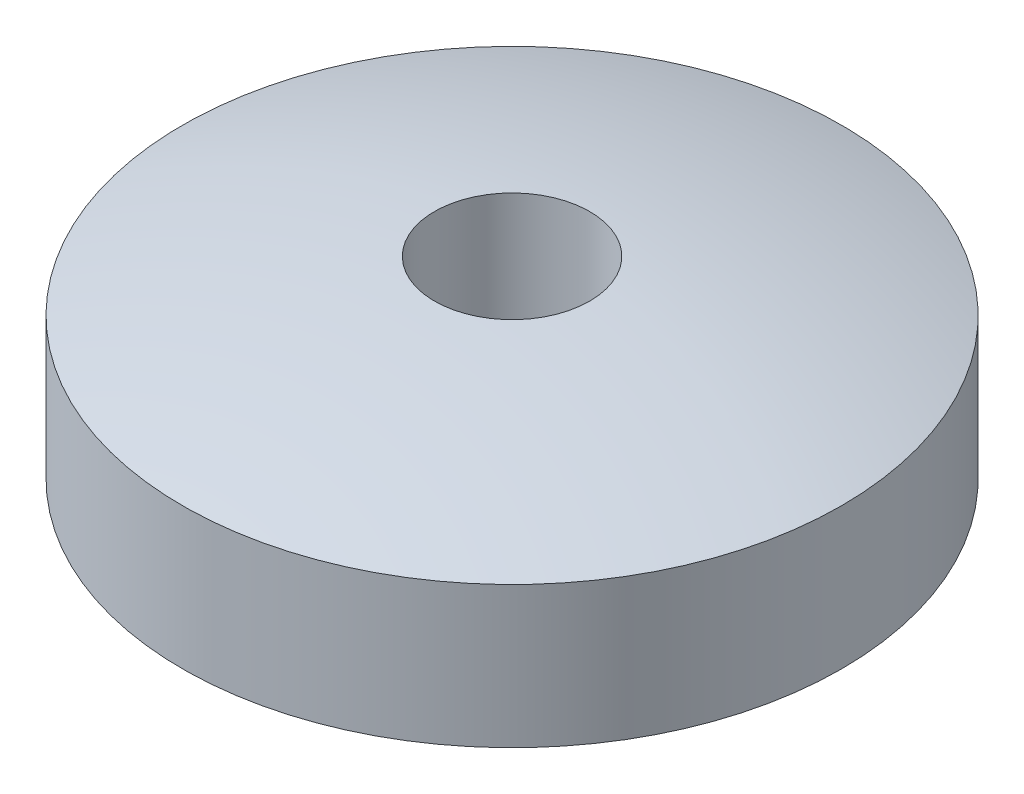
ISO-10303-21;
HEADER;
FILE_DESCRIPTION(('STEP AP214'),'2;1');
FILE_NAME('part.step','',(''),(''),'','','');
FILE_SCHEMA(('AUTOMOTIVE_DESIGN { 1 0 10303 214 1 1 1 1 }'));
ENDSEC;
DATA;
#1=APPLICATION_CONTEXT('core data for automotive mechanical design processes');
#2=APPLICATION_PROTOCOL_DEFINITION('international standard','automotive_design',2000,#1);
#3=PRODUCT_CONTEXT('',#1,'mechanical');
#4=PRODUCT('Part','Part','',(#3));
#5=PRODUCT_RELATED_PRODUCT_CATEGORY('part','',(#4));
#6=PRODUCT_DEFINITION_FORMATION('','',#4);
#7=PRODUCT_DEFINITION_CONTEXT('part definition',#1,'design');
#8=PRODUCT_DEFINITION('design','',#6,#7);
#9=PRODUCT_DEFINITION_SHAPE('','',#8);
#10=(LENGTH_UNIT() NAMED_UNIT(*) SI_UNIT(.MILLI.,.METRE.));
#11=(NAMED_UNIT(*) PLANE_ANGLE_UNIT() SI_UNIT($,.RADIAN.));
#12=(NAMED_UNIT(*) SI_UNIT($,.STERADIAN.) SOLID_ANGLE_UNIT());
#13=UNCERTAINTY_MEASURE_WITH_UNIT(LENGTH_MEASURE(1.E-05),#10,'distance_accuracy_value','');
#14=(GEOMETRIC_REPRESENTATION_CONTEXT(3) GLOBAL_UNCERTAINTY_ASSIGNED_CONTEXT((#13)) GLOBAL_UNIT_ASSIGNED_CONTEXT((#10,
#11,#12)) REPRESENTATION_CONTEXT('',''));
#15=CARTESIAN_POINT('',(0.,0.,0.));
#16=DIRECTION('',(0.,0.,1.));
#17=DIRECTION('',(1.,0.,0.));
#18=AXIS2_PLACEMENT_3D('',#15,#16,#17);
#19=CARTESIAN_POINT('',(0.,-1.14009752081384,0.));
#20=DIRECTION('',(0.,-1.,0.));
#21=DIRECTION('',(-1.,0.,0.));
#22=AXIS2_PLACEMENT_3D('',#19,#20,#21);
#23=SPHERICAL_SURFACE('',#22,1.40699999999863);
#24=CARTESIAN_POINT('',(0.,0.192999999997889,0.));
#25=DIRECTION('',(0.,-1.,0.));
#26=DIRECTION('',(1.,0.,0.));
#27=AXIS2_PLACEMENT_3D('',#24,#25,#26);
#28=CIRCLE('',#27,0.450000000000363);
#29=CARTESIAN_POINT('',(0.450000000000362,0.192999999997891,0.));
#30=VERTEX_POINT('',#29);
#31=EDGE_CURVE('E10',#30,#30,#28,.T.);
#32=ORIENTED_EDGE('',*,*,#31,.F.);
#33=EDGE_LOOP('',(#32));
#34=FACE_BOUND('',#33,.T.);
#35=CARTESIAN_POINT('',(0.,0.262903904701295,0.));
#36=DIRECTION('',(0.,-1.,0.));
#37=DIRECTION('',(1.,0.,0.));
#38=AXIS2_PLACEMENT_3D('',#35,#36,#37);
#39=CIRCLE('',#38,0.105999999999999);
#40=CARTESIAN_POINT('',(0.105999999999998,0.262903904701295,0.));
#41=VERTEX_POINT('',#40);
#42=EDGE_CURVE('E52',#41,#41,#39,.T.);
#43=ORIENTED_EDGE('',*,*,#42,.T.);
#44=EDGE_LOOP('',(#43));
#45=FACE_BOUND('',#44,.T.);
#46=ADVANCED_FACE('F33',(#34,#45),#23,.T.);
#47=CARTESIAN_POINT('',(3.49148133884313E-12,-1000.,0.));
#48=DIRECTION('',(0.,-1.,0.));
#49=DIRECTION('',(1.,0.,0.));
#50=AXIS2_PLACEMENT_3D('',#47,#48,#49);
#51=CYLINDRICAL_SURFACE('',#50,0.450000000000363);
#52=CARTESIAN_POINT('',(0.,0.,0.));
#53=DIRECTION('',(0.,-1.,0.));
#54=DIRECTION('',(1.,0.,0.));
#55=AXIS2_PLACEMENT_3D('',#52,#53,#54);
#56=CIRCLE('',#55,0.450000000000364);
#57=CARTESIAN_POINT('',(0.450000000000364,0.,0.));
#58=VERTEX_POINT('',#57);
#59=EDGE_CURVE('E39',#58,#58,#56,.T.);
#60=ORIENTED_EDGE('',*,*,#59,.F.);
#61=EDGE_LOOP('',(#60));
#62=FACE_BOUND('',#61,.T.);
#63=ORIENTED_EDGE('',*,*,#31,.T.);
#64=EDGE_LOOP('',(#63));
#65=FACE_BOUND('',#64,.T.);
#66=ADVANCED_FACE('F71',(#62,#65),#51,.T.);
#67=CARTESIAN_POINT('',(-0.450000000000364,0.,0.));
#68=DIRECTION('',(0.,1.,0.));
#69=DIRECTION('',(-1.,0.,0.));
#70=AXIS2_PLACEMENT_3D('',#67,#68,#69);
#71=PLANE('',#70);
#72=CARTESIAN_POINT('',(0.,0.,0.));
#73=DIRECTION('',(0.,-1.,0.));
#74=DIRECTION('',(1.,0.,0.));
#75=AXIS2_PLACEMENT_3D('',#72,#73,#74);
#76=CIRCLE('',#75,0.309);
#77=CARTESIAN_POINT('',(0.309,0.,0.));
#78=VERTEX_POINT('',#77);
#79=EDGE_CURVE('E43',#78,#78,#76,.T.);
#80=ORIENTED_EDGE('',*,*,#79,.F.);
#81=EDGE_LOOP('',(#80));
#82=FACE_BOUND('',#81,.T.);
#83=ORIENTED_EDGE('',*,*,#59,.T.);
#84=EDGE_LOOP('',(#83));
#85=FACE_BOUND('',#84,.T.);
#86=ADVANCED_FACE('F66',(#82,#85),#71,.F.);
#87=CARTESIAN_POINT('',(0.,-0.327137585734198,0.));
#88=DIRECTION('',(0.,-1.,0.));
#89=DIRECTION('',(-1.,0.,0.));
#90=AXIS2_PLACEMENT_3D('',#87,#88,#89);
#91=SPHERICAL_SURFACE('',#90,0.45);
#92=CARTESIAN_POINT('',(0.,0.110199812620948,0.));
#93=DIRECTION('',(0.,-1.,0.));
#94=DIRECTION('',(1.,0.,0.));
#95=AXIS2_PLACEMENT_3D('',#92,#93,#94);
#96=CIRCLE('',#95,0.106);
#97=CARTESIAN_POINT('',(0.105999999999999,0.110199812620948,0.));
#98=VERTEX_POINT('',#97);
#99=EDGE_CURVE('E47',#98,#98,#96,.T.);
#100=ORIENTED_EDGE('',*,*,#99,.F.);
#101=EDGE_LOOP('',(#100));
#102=FACE_BOUND('',#101,.T.);
#103=ORIENTED_EDGE('',*,*,#79,.T.);
#104=EDGE_LOOP('',(#103));
#105=FACE_BOUND('',#104,.T.);
#106=ADVANCED_FACE('F60',(#102,#105),#91,.F.);
#107=CARTESIAN_POINT('',(3.49148133884313E-12,-1000.,0.));
#108=DIRECTION('',(0.,-1.,0.));
#109=DIRECTION('',(1.,0.,0.));
#110=AXIS2_PLACEMENT_3D('',#107,#108,#109);
#111=CYLINDRICAL_SURFACE('',#110,0.105999999999999);
#112=ORIENTED_EDGE('',*,*,#42,.F.);
#113=EDGE_LOOP('',(#112));
#114=FACE_BOUND('',#113,.T.);
#115=ORIENTED_EDGE('',*,*,#99,.T.);
#116=EDGE_LOOP('',(#115));
#117=FACE_BOUND('',#116,.T.);
#118=ADVANCED_FACE('F57',(#114,#117),#111,.F.);
#119=CLOSED_SHELL('',(#46,#66,#86,#106,#118));
#120=MANIFOLD_SOLID_BREP('B2',#119);
#121=ADVANCED_BREP_SHAPE_REPRESENTATION('',(#18,#120),#14);
#122=SHAPE_DEFINITION_REPRESENTATION(#9,#121);
ENDSEC;
END-ISO-10303-21;
